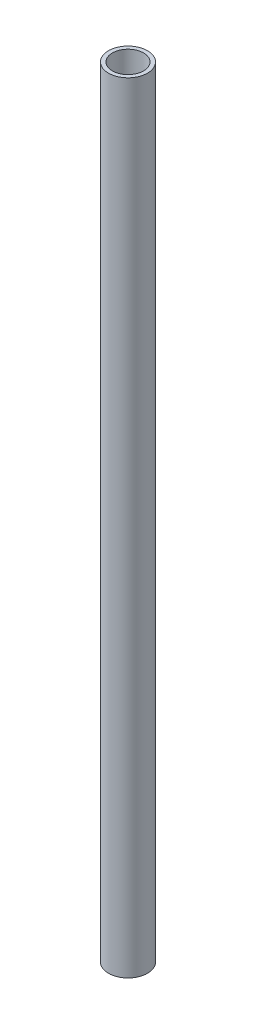
ISO-10303-21;
HEADER;
FILE_DESCRIPTION(('STEP AP214'),'2;1');
FILE_NAME('part.step','',(''),(''),'','','');
FILE_SCHEMA(('AUTOMOTIVE_DESIGN { 1 0 10303 214 1 1 1 1 }'));
ENDSEC;
DATA;
#1=APPLICATION_CONTEXT('core data for automotive mechanical design processes');
#2=APPLICATION_PROTOCOL_DEFINITION('international standard','automotive_design',2000,#1);
#3=PRODUCT_CONTEXT('',#1,'mechanical');
#4=PRODUCT('Part','Part','',(#3));
#5=PRODUCT_RELATED_PRODUCT_CATEGORY('part','',(#4));
#6=PRODUCT_DEFINITION_FORMATION('','',#4);
#7=PRODUCT_DEFINITION_CONTEXT('part definition',#1,'design');
#8=PRODUCT_DEFINITION('design','',#6,#7);
#9=PRODUCT_DEFINITION_SHAPE('','',#8);
#10=(LENGTH_UNIT() NAMED_UNIT(*) SI_UNIT(.MILLI.,.METRE.));
#11=(NAMED_UNIT(*) PLANE_ANGLE_UNIT() SI_UNIT($,.RADIAN.));
#12=(NAMED_UNIT(*) SI_UNIT($,.STERADIAN.) SOLID_ANGLE_UNIT());
#13=UNCERTAINTY_MEASURE_WITH_UNIT(LENGTH_MEASURE(1.E-05),#10,'distance_accuracy_value','');
#14=(GEOMETRIC_REPRESENTATION_CONTEXT(3) GLOBAL_UNCERTAINTY_ASSIGNED_CONTEXT((#13)) GLOBAL_UNIT_ASSIGNED_CONTEXT((#10,
#11,#12)) REPRESENTATION_CONTEXT('',''));
#15=CARTESIAN_POINT('',(0.,0.,0.));
#16=DIRECTION('',(0.,0.,1.));
#17=DIRECTION('',(1.,0.,0.));
#18=AXIS2_PLACEMENT_3D('',#15,#16,#17);
#19=CARTESIAN_POINT('',(0.,200.,0.));
#20=DIRECTION('',(0.,1.,0.));
#21=DIRECTION('',(0.,0.,1.));
#22=AXIS2_PLACEMENT_3D('',#19,#20,#21);
#23=PLANE('',#22);
#24=CARTESIAN_POINT('',(0.,200.,0.));
#25=DIRECTION('',(0.,1.,0.));
#26=DIRECTION('',(0.,0.,1.));
#27=AXIS2_PLACEMENT_3D('',#24,#25,#26);
#28=CIRCLE('',#27,5.);
#29=CARTESIAN_POINT('',(0.,200.,5.));
#30=VERTEX_POINT('',#29);
#31=EDGE_CURVE('E11',#30,#30,#28,.T.);
#32=ORIENTED_EDGE('',*,*,#31,.T.);
#33=EDGE_LOOP('',(#32));
#34=FACE_BOUND('',#33,.T.);
#35=CARTESIAN_POINT('',(0.,200.,0.));
#36=DIRECTION('',(0.,1.,0.));
#37=DIRECTION('',(1.,0.,0.));
#38=AXIS2_PLACEMENT_3D('',#35,#36,#37);
#39=CIRCLE('',#38,4.);
#40=CARTESIAN_POINT('',(4.,200.,0.));
#41=VERTEX_POINT('',#40);
#42=EDGE_CURVE('E48',#41,#41,#39,.T.);
#43=ORIENTED_EDGE('',*,*,#42,.F.);
#44=EDGE_LOOP('',(#43));
#45=FACE_BOUND('',#44,.T.);
#46=ADVANCED_FACE('F37',(#34,#45),#23,.T.);
#47=CARTESIAN_POINT('',(0.,0.,0.));
#48=DIRECTION('',(0.,1.,0.));
#49=DIRECTION('',(0.,0.,1.));
#50=AXIS2_PLACEMENT_3D('',#47,#48,#49);
#51=PLANE('',#50);
#52=CARTESIAN_POINT('',(0.,0.,0.));
#53=DIRECTION('',(0.,1.,0.));
#54=DIRECTION('',(0.,0.,1.));
#55=AXIS2_PLACEMENT_3D('',#52,#53,#54);
#56=CIRCLE('',#55,5.);
#57=CARTESIAN_POINT('',(0.,0.,5.));
#58=VERTEX_POINT('',#57);
#59=EDGE_CURVE('E41',#58,#58,#56,.T.);
#60=ORIENTED_EDGE('',*,*,#59,.F.);
#61=EDGE_LOOP('',(#60));
#62=FACE_BOUND('',#61,.T.);
#63=CARTESIAN_POINT('',(0.,0.,0.));
#64=DIRECTION('',(0.,1.,0.));
#65=DIRECTION('',(1.,0.,0.));
#66=AXIS2_PLACEMENT_3D('',#63,#64,#65);
#67=CIRCLE('',#66,4.);
#68=CARTESIAN_POINT('',(4.,0.,0.));
#69=VERTEX_POINT('',#68);
#70=EDGE_CURVE('E50',#69,#69,#67,.T.);
#71=ORIENTED_EDGE('',*,*,#70,.T.);
#72=EDGE_LOOP('',(#71));
#73=FACE_BOUND('',#72,.T.);
#74=ADVANCED_FACE('F60',(#62,#73),#51,.F.);
#75=CARTESIAN_POINT('',(0.,200.,0.));
#76=DIRECTION('',(0.,-1.,0.));
#77=DIRECTION('',(0.,0.,-1.));
#78=AXIS2_PLACEMENT_3D('',#75,#76,#77);
#79=CYLINDRICAL_SURFACE('',#78,5.);
#80=ORIENTED_EDGE('',*,*,#31,.F.);
#81=EDGE_LOOP('',(#80));
#82=FACE_BOUND('',#81,.T.);
#83=ORIENTED_EDGE('',*,*,#59,.T.);
#84=EDGE_LOOP('',(#83));
#85=FACE_BOUND('',#84,.T.);
#86=ADVANCED_FACE('F39',(#82,#85),#79,.T.);
#87=CARTESIAN_POINT('',(0.,200.,0.));
#88=DIRECTION('',(0.,-1.,0.));
#89=DIRECTION('',(0.,0.,-1.));
#90=AXIS2_PLACEMENT_3D('',#87,#88,#89);
#91=CYLINDRICAL_SURFACE('',#90,4.);
#92=ORIENTED_EDGE('',*,*,#42,.T.);
#93=EDGE_LOOP('',(#92));
#94=FACE_BOUND('',#93,.T.);
#95=ORIENTED_EDGE('',*,*,#70,.F.);
#96=EDGE_LOOP('',(#95));
#97=FACE_BOUND('',#96,.T.);
#98=ADVANCED_FACE('F56',(#94,#97),#91,.F.);
#99=CLOSED_SHELL('',(#46,#74,#86,#98));
#100=MANIFOLD_SOLID_BREP('B2',#99);
#101=ADVANCED_BREP_SHAPE_REPRESENTATION('',(#18,#100),#14);
#102=SHAPE_DEFINITION_REPRESENTATION(#9,#101);
ENDSEC;
END-ISO-10303-21;
